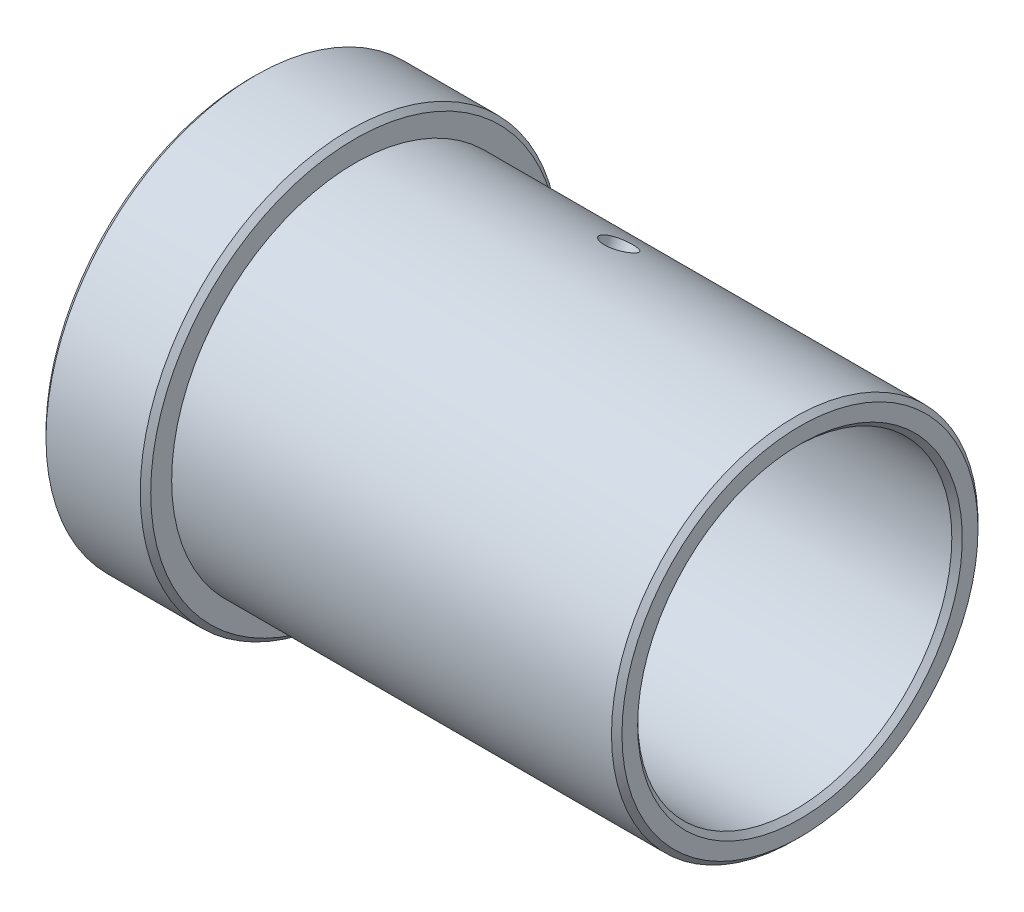
ISO-10303-21;
HEADER;
FILE_DESCRIPTION(('STEP AP214'),'2;1');
FILE_NAME('part.step','',(''),(''),'','','');
FILE_SCHEMA(('AUTOMOTIVE_DESIGN { 1 0 10303 214 1 1 1 1 }'));
ENDSEC;
DATA;
#1=APPLICATION_CONTEXT('core data for automotive mechanical design processes');
#2=APPLICATION_PROTOCOL_DEFINITION('international standard','automotive_design',2000,#1);
#3=PRODUCT_CONTEXT('',#1,'mechanical');
#4=PRODUCT('Part','Part','',(#3));
#5=PRODUCT_RELATED_PRODUCT_CATEGORY('part','',(#4));
#6=PRODUCT_DEFINITION_FORMATION('','',#4);
#7=PRODUCT_DEFINITION_CONTEXT('part definition',#1,'design');
#8=PRODUCT_DEFINITION('design','',#6,#7);
#9=PRODUCT_DEFINITION_SHAPE('','',#8);
#10=(LENGTH_UNIT() NAMED_UNIT(*) SI_UNIT(.MILLI.,.METRE.));
#11=(NAMED_UNIT(*) PLANE_ANGLE_UNIT() SI_UNIT($,.RADIAN.));
#12=(NAMED_UNIT(*) SI_UNIT($,.STERADIAN.) SOLID_ANGLE_UNIT());
#13=UNCERTAINTY_MEASURE_WITH_UNIT(LENGTH_MEASURE(1.E-05),#10,'distance_accuracy_value','');
#14=(GEOMETRIC_REPRESENTATION_CONTEXT(3) GLOBAL_UNCERTAINTY_ASSIGNED_CONTEXT((#13)) GLOBAL_UNIT_ASSIGNED_CONTEXT((#10,
#11,#12)) REPRESENTATION_CONTEXT('',''));
#15=CARTESIAN_POINT('',(0.,0.,0.));
#16=DIRECTION('',(0.,0.,1.));
#17=DIRECTION('',(1.,0.,0.));
#18=AXIS2_PLACEMENT_3D('',#15,#16,#17);
#19=CARTESIAN_POINT('',(0.,0.,0.));
#20=DIRECTION('',(-1.,0.,0.));
#21=DIRECTION('',(0.,0.,1.));
#22=AXIS2_PLACEMENT_3D('',#19,#20,#21);
#23=CYLINDRICAL_SURFACE('',#22,30.);
#24=CARTESIAN_POINT('',(104.,0.,0.));
#25=DIRECTION('',(-1.,0.,0.));
#26=DIRECTION('',(0.,0.,1.));
#27=AXIS2_PLACEMENT_3D('',#24,#25,#26);
#28=CIRCLE('',#27,30.);
#29=CARTESIAN_POINT('',(104.,0.,30.));
#30=VERTEX_POINT('',#29);
#31=EDGE_CURVE('E77',#30,#30,#28,.F.);
#32=ORIENTED_EDGE('',*,*,#31,.T.);
#33=EDGE_LOOP('',(#32));
#34=FACE_BOUND('',#33,.T.);
#35=CARTESIAN_POINT('',(0.999999999999985,0.,0.));
#36=DIRECTION('',(1.,0.,0.));
#37=DIRECTION('',(0.,0.,-1.));
#38=AXIS2_PLACEMENT_3D('',#35,#36,#37);
#39=CIRCLE('',#38,30.);
#40=CARTESIAN_POINT('',(0.999999999999985,0.,-30.));
#41=VERTEX_POINT('',#40);
#42=EDGE_CURVE('E80',#41,#41,#39,.F.);
#43=ORIENTED_EDGE('',*,*,#42,.T.);
#44=EDGE_LOOP('',(#43));
#45=FACE_BOUND('',#44,.T.);
#46=CARTESIAN_POINT('',(55.,25.4821235078622,-15.8322892068727));
#47=CARTESIAN_POINT('',(55.1680586925268,25.4821284814457,-15.8322835374842));
#48=CARTESIAN_POINT('',(55.3362285052549,25.4896484346966,-15.8201976358381));
#49=CARTESIAN_POINT('',(55.6679055588989,25.5194270348919,-15.7721150314666));
#50=CARTESIAN_POINT('',(55.8314074541161,25.5417019244503,-15.7360919779697));
#51=CARTESIAN_POINT('',(56.1488974576473,25.600019021593,-15.6410394826798));
#52=CARTESIAN_POINT('',(56.3028912681726,25.6360528825922,-15.5820239883173));
#53=CARTESIAN_POINT('',(56.597103376877,25.72036704279,-15.4424523564029));
#54=CARTESIAN_POINT('',(56.7373244034516,25.7686449096291,-15.3619004970317));
#55=CARTESIAN_POINT('',(57.000553790972,25.8756689901483,-15.1809356798347));
#56=CARTESIAN_POINT('',(57.1235050285112,25.9344485485519,-15.0804593431792));
#57=CARTESIAN_POINT('',(57.3482128270108,26.0600760895089,-14.8623095281687));
#58=CARTESIAN_POINT('',(57.449968418219,26.1269244410083,-14.7446352633855));
#59=CARTESIAN_POINT('',(57.6295937710214,26.2663412395531,-14.4948194388529));
#60=CARTESIAN_POINT('',(57.707412996381,26.3389213877216,-14.362648058539));
#61=CARTESIAN_POINT('',(57.8366332994461,26.4870945543933,-14.0875195980929));
#62=CARTESIAN_POINT('',(57.8880350211084,26.5626874994077,-13.9445627809656));
#63=CARTESIAN_POINT('',(57.9627937280598,26.7140987576482,-13.652249471918));
#64=CARTESIAN_POINT('',(57.9862444982498,26.7899154566498,-13.5029161326779));
#65=CARTESIAN_POINT('',(58.0047258074012,26.9396833855675,-13.201581770388));
#66=CARTESIAN_POINT('',(57.9997570832388,27.0136346638014,-13.0495808166074));
#67=CARTESIAN_POINT('',(57.9616165820495,27.1573367276951,-12.7478194164657));
#68=CARTESIAN_POINT('',(57.9285456533083,27.227101579624,-12.5980529046384));
#69=CARTESIAN_POINT('',(57.8352966131601,27.3609908490052,-12.3045607133587));
#70=CARTESIAN_POINT('',(57.7751181496373,27.4251151931767,-12.1608351124018));
#71=CARTESIAN_POINT('',(57.6292517102367,27.5464566157226,-11.8834218530757));
#72=CARTESIAN_POINT('',(57.5435191074095,27.6036613621877,-11.7497522719382));
#73=CARTESIAN_POINT('',(57.3490104299909,27.7099979778308,-11.4967332781471));
#74=CARTESIAN_POINT('',(57.2402336795645,27.7591296101666,-11.3773842856462));
#75=CARTESIAN_POINT('',(57.0021573114591,27.8487798140327,-11.1561553836747));
#76=CARTESIAN_POINT('',(56.8727699657753,27.8892597526081,-11.0543542071557));
#77=CARTESIAN_POINT('',(56.5974494043677,27.9608322274898,-10.8720505560648));
#78=CARTESIAN_POINT('',(56.4515161646436,27.9919247501792,-10.7915481123878));
#79=CARTESIAN_POINT('',(56.1471789244006,28.0444114552492,-10.654407792725));
#80=CARTESIAN_POINT('',(55.9887723027313,28.065803592778,-10.5977749486539));
#81=CARTESIAN_POINT('',(55.6640181861559,28.098694358771,-10.5102607225316));
#82=CARTESIAN_POINT('',(55.4976709333377,28.1101932886485,-10.4793785559429));
#83=CARTESIAN_POINT('',(55.1625274614115,28.1231820887286,-10.4444713196383));
#84=CARTESIAN_POINT('',(54.9937449392055,28.1247150164341,-10.4403307151518));
#85=CARTESIAN_POINT('',(54.6578462025314,28.1178752139908,-10.4587373077393));
#86=CARTESIAN_POINT('',(54.4907299655789,28.1095026176875,-10.4812841442075));
#87=CARTESIAN_POINT('',(54.163265253165,28.0829425408111,-10.5522392692784));
#88=CARTESIAN_POINT('',(54.002903286716,28.0647757338674,-10.6005930823382));
#89=CARTESIAN_POINT('',(53.6930798448091,28.0187888202506,-10.7215500308448));
#90=CARTESIAN_POINT('',(53.5436186191385,27.9909684924539,-10.794153721758));
#91=CARTESIAN_POINT('',(53.2592800779137,27.9258274382962,-10.9615796082132));
#92=CARTESIAN_POINT('',(53.1244541741012,27.8884746732919,-11.0564766447761));
#93=CARTESIAN_POINT('',(52.8737348401778,27.8047452013612,-11.2653794611083));
#94=CARTESIAN_POINT('',(52.7578418789798,27.7583682709952,-11.3793857140147));
#95=CARTESIAN_POINT('',(52.5478550998057,27.6570595074037,-11.6234481140415));
#96=CARTESIAN_POINT('',(52.4538413212413,27.6020974555902,-11.7535606039818));
#97=CARTESIAN_POINT('',(52.2908323944808,27.4846877209687,-12.0255499538576));
#98=CARTESIAN_POINT('',(52.2218369034787,27.4222401407445,-12.1674266525647));
#99=CARTESIAN_POINT('',(52.110958697034,27.291263029686,-12.458425027677));
#100=CARTESIAN_POINT('',(52.0690276380244,27.2227445933224,-12.6075332715289));
#101=CARTESIAN_POINT('',(52.0133107912605,27.0811738841439,-12.9088230121345));
#102=CARTESIAN_POINT('',(51.9995242124979,27.0081217388096,-13.0610044223947));
#103=CARTESIAN_POINT('',(52.0004987993198,26.859798202844,-13.3633631514256));
#104=CARTESIAN_POINT('',(52.01513571051,26.784537881668,-13.5135463162776));
#105=CARTESIAN_POINT('',(52.0722812369709,26.633744948393,-13.8083690537843));
#106=CARTESIAN_POINT('',(52.1147898741189,26.5582123360802,-13.9530086220878));
#107=CARTESIAN_POINT('',(52.2264377721788,26.4093316844748,-14.2327906467814));
#108=CARTESIAN_POINT('',(52.2955734008025,26.3359833486864,-14.3679343955602));
#109=CARTESIAN_POINT('',(52.4584995067509,26.193991697775,-14.6251979228174));
#110=CARTESIAN_POINT('',(52.5522898398134,26.1253483551245,-14.7473177774969));
#111=CARTESIAN_POINT('',(52.7623288570713,25.9949901096164,-14.9759108305594));
#112=CARTESIAN_POINT('',(52.8786700487344,25.9333054605788,-15.0823162842988));
#113=CARTESIAN_POINT('',(53.1303260546363,25.8195591778534,-15.276224552438));
#114=CARTESIAN_POINT('',(53.2656454155072,25.7674998570708,-15.3637228244121));
#115=CARTESIAN_POINT('',(53.5517930257598,25.6749993406956,-15.5178133497399));
#116=CARTESIAN_POINT('',(53.7026598439722,25.6345880305175,-15.5843518663103));
#117=CARTESIAN_POINT('',(54.0152448737386,25.5672959735576,-15.6945080006873));
#118=CARTESIAN_POINT('',(54.1769506117769,25.5403999662677,-15.7381514723922));
#119=CARTESIAN_POINT('',(54.4496432226975,25.5079978177134,-15.7905860031988));
#120=CARTESIAN_POINT('',(54.5588867539198,25.4983137343006,-15.8062060380578));
#121=CARTESIAN_POINT('',(54.7787374691272,25.4853749554845,-15.8270594845498));
#122=CARTESIAN_POINT('',(54.8893446473859,25.4821202330917,-15.832292939784));
#123=CARTESIAN_POINT('',(55.,25.4821235078622,-15.8322892068727));
#124=B_SPLINE_CURVE_WITH_KNOTS('',3,(#46,#47,#48,#49,#50,#51,#52,#53,#54,#55,#56,#57,#58,#59,
#60,#61,#62,#63,#64,#65,#66,#67,#68,#69,#70,#71,#72,#73,#74,#75,#76,#77,#78,#79,#80,#81,#82,#83,
#84,#85,#86,#87,#88,#89,#90,#91,#92,#93,#94,#95,#96,#97,#98,#99,#100,#101,#102,#103,#104,#105,
#106,#107,#108,#109,#110,#111,#112,#113,#114,#115,#116,#117,#118,#119,#120,#121,#122,#123),
.UNSPECIFIED.,.T.,.F.,(4,2,2,2,2,2,2,2,2,2,2,2,2,2,2,2,2,2,2,2,2,2,2,2,2,2,2,2,2,2,2,2,2,2,2,2,
2,2,4),(0.,0.503771983318817,1.00809945548361,1.51212147301072,2.01604344128224,
2.52159484591606,3.02716937567589,3.53380409915706,4.04042647225215,4.5453441269718,
5.05024868996528,5.55334895457816,6.05645575444755,6.56044636401072,7.06445175657417,
7.57066275256835,8.07687448284519,8.58319287355632,9.0894958378693,9.59360988925127,
10.0977171290244,10.6007644411541,11.1038232768497,11.6085956943698,12.1133806117144,
12.6199841045619,13.1265806555585,13.6322697808491,14.1379446934128,14.6414140040728,
15.1448837099181,15.6482847598757,16.1516828643423,16.657191451158,17.1628213510541,
17.6697372321326,18.1760794468383,18.5077808281997,18.8394808171328),.UNSPECIFIED.);
#125=CARTESIAN_POINT('',(55.,25.4821235078622,-15.8322892068727));
#126=VERTEX_POINT('',#125);
#127=EDGE_CURVE('E92',#126,#126,#124,.T.);
#128=ORIENTED_EDGE('',*,*,#127,.F.);
#129=EDGE_LOOP('',(#128));
#130=FACE_BOUND('',#129,.T.);
#131=ADVANCED_FACE('F45',(#34,#45,#130),#23,.F.);
#132=CARTESIAN_POINT('',(0.,0.,0.));
#133=DIRECTION('',(-1.,0.,0.));
#134=DIRECTION('',(0.,0.,1.));
#135=AXIS2_PLACEMENT_3D('',#132,#133,#134);
#136=CYLINDRICAL_SURFACE('',#135,35.);
#137=CARTESIAN_POINT('',(104.,0.,0.));
#138=DIRECTION('',(-1.,0.,0.));
#139=DIRECTION('',(0.,0.,1.));
#140=AXIS2_PLACEMENT_3D('',#137,#138,#139);
#141=CIRCLE('',#140,35.);
#142=CARTESIAN_POINT('',(104.,0.,35.));
#143=VERTEX_POINT('',#142);
#144=EDGE_CURVE('E74',#143,#143,#141,.T.);
#145=ORIENTED_EDGE('',*,*,#144,.T.);
#146=EDGE_LOOP('',(#145));
#147=FACE_BOUND('',#146,.T.);
#148=CARTESIAN_POINT('',(20.,0.,0.));
#149=DIRECTION('',(-1.,0.,0.));
#150=DIRECTION('',(0.,0.,1.));
#151=AXIS2_PLACEMENT_3D('',#148,#149,#150);
#152=CIRCLE('',#151,35.);
#153=CARTESIAN_POINT('',(20.,0.,35.));
#154=VERTEX_POINT('',#153);
#155=EDGE_CURVE('E89',#154,#154,#152,.T.);
#156=ORIENTED_EDGE('',*,*,#155,.F.);
#157=EDGE_LOOP('',(#156));
#158=FACE_BOUND('',#157,.T.);
#159=CARTESIAN_POINT('',(55.,29.9910938663542,-18.0425687943688));
#160=CARTESIAN_POINT('',(54.8318211022031,29.9910986269096,-18.042562954599));
#161=CARTESIAN_POINT('',(54.6635281444135,29.9984437679033,-18.0303688947264));
#162=CARTESIAN_POINT('',(54.331599928892,30.027545382464,-17.9818599549949));
#163=CARTESIAN_POINT('',(54.1679701474462,30.049318126291,-17.9455178428279));
#164=CARTESIAN_POINT('',(53.8502236835194,30.1063690354561,-17.8496396804783));
#165=CARTESIAN_POINT('',(53.6961016169177,30.1416394741331,-17.7901168995642));
#166=CARTESIAN_POINT('',(53.4016582013193,30.2242571782809,-17.6493881952773));
#167=CARTESIAN_POINT('',(53.2613339381889,30.2716018860092,-17.568186863991));
#168=CARTESIAN_POINT('',(52.9980531789911,30.3766508800125,-17.3859178496988));
#169=CARTESIAN_POINT('',(52.8751392165071,30.4343797805365,-17.2848029091001));
#170=CARTESIAN_POINT('',(52.6505336642643,30.5579433481812,-17.0654011570217));
#171=CARTESIAN_POINT('',(52.5488430073913,30.6237783714103,-16.947113591094));
#172=CARTESIAN_POINT('',(52.3694283036221,30.7612751331111,-16.6962394849455));
#173=CARTESIAN_POINT('',(52.2917411960924,30.8329456398523,-16.5636313255907));
#174=CARTESIAN_POINT('',(52.1627751263907,30.9795418603791,-16.2877977002581));
#175=CARTESIAN_POINT('',(52.1114956781334,31.0544675142198,-16.1445724297648));
#176=CARTESIAN_POINT('',(52.0369233755909,31.2049316078513,-15.8517901946811));
#177=CARTESIAN_POINT('',(52.0135615290964,31.2804680706289,-15.7022497884083));
#178=CARTESIAN_POINT('',(51.9952742830879,31.430030834878,-15.400697451729));
#179=CARTESIAN_POINT('',(52.0003483272502,31.5040571658655,-15.2486855697329));
#180=CARTESIAN_POINT('',(52.0387324610289,31.6483297219421,-14.9469437582818));
#181=CARTESIAN_POINT('',(52.0719683603836,31.7185853640029,-14.7972088842852));
#182=CARTESIAN_POINT('',(52.165617371239,31.8537499464227,-14.5039546281513));
#183=CARTESIAN_POINT('',(52.2260307539906,31.9186588334096,-14.3604353080653));
#184=CARTESIAN_POINT('',(52.372402327149,32.0417506049493,-14.083650625314));
#185=CARTESIAN_POINT('',(52.4583936918608,32.0999246174932,-13.9503988638708));
#186=CARTESIAN_POINT('',(52.6534561621967,32.2083016254089,-13.6983269206173));
#187=CARTESIAN_POINT('',(52.7625277635218,32.2585044495405,-13.5795070488512));
#188=CARTESIAN_POINT('',(53.0010725884121,32.3502248823872,-13.3595370038661));
#189=CARTESIAN_POINT('',(53.1306102882316,32.3917140435446,-13.2584448785054));
#190=CARTESIAN_POINT('',(53.406185663845,32.4651788356725,-13.0775275941522));
#191=CARTESIAN_POINT('',(53.5522233544131,32.4971544581244,-12.9977024542025));
#192=CARTESIAN_POINT('',(53.8566991911418,32.5511719253076,-12.8618264417753));
#193=CARTESIAN_POINT('',(54.0151389919861,32.5732124418412,-12.8057787480995));
#194=CARTESIAN_POINT('',(54.3398994886251,32.6070881236893,-12.7192759674394));
#195=CARTESIAN_POINT('',(54.5062200089057,32.6189235161727,-12.6888203107692));
#196=CARTESIAN_POINT('',(54.8414548095081,32.6322353972081,-12.6545468771331));
#197=CARTESIAN_POINT('',(55.0103591658262,32.6337446903427,-12.6506447435274));
#198=CARTESIAN_POINT('',(55.3464641685157,32.626474960573,-12.6693815432767));
#199=CARTESIAN_POINT('',(55.5136648316971,32.6176960392802,-12.6920202145016));
#200=CARTESIAN_POINT('',(55.8413568051811,32.5899683501166,-12.763048140015));
#201=CARTESIAN_POINT('',(56.0018579621147,32.571035117787,-12.8113980565472));
#202=CARTESIAN_POINT('',(56.3119000388947,32.5232286235924,-12.9322774386724));
#203=CARTESIAN_POINT('',(56.461440772822,32.4943551931616,-13.0048073143087));
#204=CARTESIAN_POINT('',(56.7457295680083,32.4269503115543,-13.171978039517));
#205=CARTESIAN_POINT('',(56.8804395313929,32.3883947846504,-13.2666739672662));
#206=CARTESIAN_POINT('',(57.1308576448824,32.3022159328818,-13.4751450623433));
#207=CARTESIAN_POINT('',(57.2465654491355,32.2545924430083,-13.588920576856));
#208=CARTESIAN_POINT('',(57.4560029728843,32.1509246692412,-13.832409905963));
#209=CARTESIAN_POINT('',(57.549674065437,32.0948585592977,-13.9621648677758));
#210=CARTESIAN_POINT('',(57.7119767717214,31.9754674227437,-14.2334611860138));
#211=CARTESIAN_POINT('',(57.7806086481032,31.9121424722844,-14.3750024187872));
#212=CARTESIAN_POINT('',(57.8907842087084,31.7797055555372,-14.6654606440385));
#213=CARTESIAN_POINT('',(57.932364035361,31.7106014503584,-14.8143675082185));
#214=CARTESIAN_POINT('',(57.9873733013822,31.5682373535997,-15.1153595140001));
#215=CARTESIAN_POINT('',(58.0008033075618,31.4949774457296,-15.2674445915446));
#216=CARTESIAN_POINT('',(57.9991249178628,31.3465478491248,-15.5699142268392));
#217=CARTESIAN_POINT('',(57.9841078420171,31.2713850331305,-15.72030267234));
#218=CARTESIAN_POINT('',(57.9261521408573,31.1211575096714,-16.015649102357));
#219=CARTESIAN_POINT('',(57.8832134794582,31.0460928023334,-16.1606070798549));
#220=CARTESIAN_POINT('',(57.7706569781232,30.8984607950413,-16.4411149547112));
#221=CARTESIAN_POINT('',(57.701040922428,30.8258933284201,-16.576665480544));
#222=CARTESIAN_POINT('',(57.5371161153677,30.6857031623583,-16.8347621628325));
#223=CARTESIAN_POINT('',(57.4428077217697,30.6180803912923,-16.9573085076694));
#224=CARTESIAN_POINT('',(57.2318324384592,30.4899804575952,-17.1865767376603));
#225=CARTESIAN_POINT('',(57.1150978861274,30.4295258383844,-17.2932489545616));
#226=CARTESIAN_POINT('',(56.8627082072799,30.3182442996148,-17.4876139341155));
#227=CARTESIAN_POINT('',(56.7270485112192,30.2674197122725,-17.5753020999116));
#228=CARTESIAN_POINT('',(56.4403813349937,30.1772998505576,-17.7295966693167));
#229=CARTESIAN_POINT('',(56.2893442935208,30.1380273695206,-17.7961614146499));
#230=CARTESIAN_POINT('',(55.9765267772395,30.0727632433514,-17.9062291764364));
#231=CARTESIAN_POINT('',(55.8147588646337,30.0467563682667,-17.9497586413536));
#232=CARTESIAN_POINT('',(55.5433679219208,30.0156960783794,-18.0016253880285));
#233=CARTESIAN_POINT('',(55.4354890428811,30.0064870523051,-18.0169608836886));
#234=CARTESIAN_POINT('',(55.218422813093,29.9941844090435,-18.0374344687274));
#235=CARTESIAN_POINT('',(55.109235466106,29.9910907742809,-18.0425725874129));
#236=CARTESIAN_POINT('',(55.,29.9910938663542,-18.0425687943688));
#237=B_SPLINE_CURVE_WITH_KNOTS('',3,(#159,#160,#161,#162,#163,#164,#165,#166,#167,#168,#169,
#170,#171,#172,#173,#174,#175,#176,#177,#178,#179,#180,#181,#182,#183,#184,#185,#186,#187,#188,
#189,#190,#191,#192,#193,#194,#195,#196,#197,#198,#199,#200,#201,#202,#203,#204,#205,#206,#207,
#208,#209,#210,#211,#212,#213,#214,#215,#216,#217,#218,#219,#220,#221,#222,#223,#224,#225,#226,
#227,#228,#229,#230,#231,#232,#233,#234,#235,#236),.UNSPECIFIED.,.T.,.F.,(4,2,2,2,2,2,2,2,2,2,2,
2,2,2,2,2,2,2,2,2,2,2,2,2,2,2,2,2,2,2,2,2,2,2,2,2,2,2,4),(0.,0.504137845154901,1.0088451851254,
1.51326404003696,2.01757613044269,2.52309976273197,3.0286456110007,3.53496561920689,
4.04127630725864,4.5463331550716,5.0513801219166,5.55510070289604,6.05882631148134,
6.56320811562686,7.06760075362891,7.57361533214637,8.07963036375614,8.5857130231065,
9.09178441661877,9.5962473420388,10.1007052851759,10.6043936277359,11.1080905122643,
11.6130525231886,12.1180237237333,12.6243235404852,13.1306180462274,13.6362347291713,
14.1418412311696,14.6458273992463,15.1498142186598,15.653767336246,16.1577131524622,
16.6632040203355,17.1688171527569,17.6754213142689,18.1814425380561,18.5088908177617,
18.836338156391),.UNSPECIFIED.);
#238=CARTESIAN_POINT('',(55.,29.9910938663542,-18.0425687943688));
#239=VERTEX_POINT('',#238);
#240=EDGE_CURVE('E50',#239,#239,#237,.T.);
#241=ORIENTED_EDGE('',*,*,#240,.F.);
#242=EDGE_LOOP('',(#241));
#243=FACE_BOUND('',#242,.T.);
#244=ADVANCED_FACE('F111',(#147,#158,#243),#136,.T.);
#245=CARTESIAN_POINT('',(0.,0.,0.));
#246=DIRECTION('',(-1.,0.,0.));
#247=DIRECTION('',(0.,0.,1.));
#248=AXIS2_PLACEMENT_3D('',#245,#246,#247);
#249=CYLINDRICAL_SURFACE('',#248,40.);
#250=CARTESIAN_POINT('',(1.00000000000002,0.,0.));
#251=DIRECTION('',(1.,0.,0.));
#252=DIRECTION('',(0.,0.,-1.));
#253=AXIS2_PLACEMENT_3D('',#250,#251,#252);
#254=CIRCLE('',#253,40.);
#255=CARTESIAN_POINT('',(1.00000000000002,0.,-40.));
#256=VERTEX_POINT('',#255);
#257=EDGE_CURVE('E59',#256,#256,#254,.T.);
#258=ORIENTED_EDGE('',*,*,#257,.T.);
#259=EDGE_LOOP('',(#258));
#260=FACE_BOUND('',#259,.T.);
#261=CARTESIAN_POINT('',(19.,0.,0.));
#262=DIRECTION('',(-1.,0.,0.));
#263=DIRECTION('',(0.,0.,1.));
#264=AXIS2_PLACEMENT_3D('',#261,#262,#263);
#265=CIRCLE('',#264,40.);
#266=CARTESIAN_POINT('',(19.,0.,40.));
#267=VERTEX_POINT('',#266);
#268=EDGE_CURVE('E63',#267,#267,#265,.T.);
#269=ORIENTED_EDGE('',*,*,#268,.T.);
#270=EDGE_LOOP('',(#269));
#271=FACE_BOUND('',#270,.T.);
#272=ADVANCED_FACE('F114',(#260,#271),#249,.T.);
#273=CARTESIAN_POINT('',(0.,40.,0.));
#274=DIRECTION('',(1.,0.,0.));
#275=DIRECTION('',(0.,0.,-1.));
#276=AXIS2_PLACEMENT_3D('',#273,#274,#275);
#277=PLANE('',#276);
#278=CARTESIAN_POINT('',(0.,0.,0.));
#279=DIRECTION('',(1.,0.,0.));
#280=DIRECTION('',(0.,0.,-1.));
#281=AXIS2_PLACEMENT_3D('',#278,#279,#280);
#282=CIRCLE('',#281,39.);
#283=CARTESIAN_POINT('',(0.,0.,-39.));
#284=VERTEX_POINT('',#283);
#285=EDGE_CURVE('E68',#284,#284,#282,.F.);
#286=ORIENTED_EDGE('',*,*,#285,.T.);
#287=EDGE_LOOP('',(#286));
#288=FACE_BOUND('',#287,.T.);
#289=CARTESIAN_POINT('',(0.,0.,0.));
#290=DIRECTION('',(1.,0.,0.));
#291=DIRECTION('',(0.,0.,-1.));
#292=AXIS2_PLACEMENT_3D('',#289,#290,#291);
#293=CIRCLE('',#292,31.);
#294=CARTESIAN_POINT('',(0.,0.,-31.));
#295=VERTEX_POINT('',#294);
#296=EDGE_CURVE('E71',#295,#295,#293,.T.);
#297=ORIENTED_EDGE('',*,*,#296,.T.);
#298=EDGE_LOOP('',(#297));
#299=FACE_BOUND('',#298,.T.);
#300=ADVANCED_FACE('F117',(#288,#299),#277,.F.);
#301=CARTESIAN_POINT('',(105.,30.,0.));
#302=DIRECTION('',(-1.,0.,0.));
#303=DIRECTION('',(0.,0.,1.));
#304=AXIS2_PLACEMENT_3D('',#301,#302,#303);
#305=PLANE('',#304);
#306=CARTESIAN_POINT('',(105.,0.,0.));
#307=DIRECTION('',(-1.,0.,0.));
#308=DIRECTION('',(0.,0.,1.));
#309=AXIS2_PLACEMENT_3D('',#306,#307,#308);
#310=CIRCLE('',#309,31.);
#311=CARTESIAN_POINT('',(105.,0.,31.));
#312=VERTEX_POINT('',#311);
#313=EDGE_CURVE('E83',#312,#312,#310,.T.);
#314=ORIENTED_EDGE('',*,*,#313,.T.);
#315=EDGE_LOOP('',(#314));
#316=FACE_BOUND('',#315,.T.);
#317=CARTESIAN_POINT('',(105.,0.,0.));
#318=DIRECTION('',(-1.,0.,0.));
#319=DIRECTION('',(0.,0.,1.));
#320=AXIS2_PLACEMENT_3D('',#317,#318,#319);
#321=CIRCLE('',#320,34.);
#322=CARTESIAN_POINT('',(105.,0.,34.));
#323=VERTEX_POINT('',#322);
#324=EDGE_CURVE('E86',#323,#323,#321,.F.);
#325=ORIENTED_EDGE('',*,*,#324,.T.);
#326=EDGE_LOOP('',(#325));
#327=FACE_BOUND('',#326,.T.);
#328=ADVANCED_FACE('F110',(#316,#327),#305,.F.);
#329=CARTESIAN_POINT('',(20.,35.,0.));
#330=DIRECTION('',(-1.,0.,0.));
#331=DIRECTION('',(0.,0.,1.));
#332=AXIS2_PLACEMENT_3D('',#329,#330,#331);
#333=PLANE('',#332);
#334=CARTESIAN_POINT('',(20.,0.,0.));
#335=DIRECTION('',(-1.,0.,0.));
#336=DIRECTION('',(0.,0.,1.));
#337=AXIS2_PLACEMENT_3D('',#334,#335,#336);
#338=CIRCLE('',#337,39.);
#339=CARTESIAN_POINT('',(20.,0.,39.));
#340=VERTEX_POINT('',#339);
#341=EDGE_CURVE('E10',#340,#340,#338,.F.);
#342=ORIENTED_EDGE('',*,*,#341,.T.);
#343=EDGE_LOOP('',(#342));
#344=FACE_BOUND('',#343,.T.);
#345=ORIENTED_EDGE('',*,*,#155,.T.);
#346=EDGE_LOOP('',(#345));
#347=FACE_BOUND('',#346,.T.);
#348=ADVANCED_FACE('F106',(#344,#347),#333,.F.);
#349=CARTESIAN_POINT('',(105.,0.,0.));
#350=DIRECTION('',(1.,0.,0.));
#351=DIRECTION('',(0.,0.,-1.));
#352=AXIS2_PLACEMENT_3D('',#349,#350,#351);
#353=CONICAL_SURFACE('',#352,31.,0.785398163397447);
#354=ORIENTED_EDGE('',*,*,#31,.F.);
#355=EDGE_LOOP('',(#354));
#356=FACE_BOUND('',#355,.T.);
#357=ORIENTED_EDGE('',*,*,#313,.F.);
#358=EDGE_LOOP('',(#357));
#359=FACE_BOUND('',#358,.T.);
#360=ADVANCED_FACE('F109',(#356,#359),#353,.F.);
#361=CARTESIAN_POINT('',(104.,0.,0.));
#362=DIRECTION('',(-1.,0.,0.));
#363=DIRECTION('',(0.,0.,1.));
#364=AXIS2_PLACEMENT_3D('',#361,#362,#363);
#365=CONICAL_SURFACE('',#364,35.,0.785398163397448);
#366=ORIENTED_EDGE('',*,*,#324,.F.);
#367=EDGE_LOOP('',(#366));
#368=FACE_BOUND('',#367,.T.);
#369=ORIENTED_EDGE('',*,*,#144,.F.);
#370=EDGE_LOOP('',(#369));
#371=FACE_BOUND('',#370,.T.);
#372=ADVANCED_FACE('F144',(#368,#371),#365,.T.);
#373=CARTESIAN_POINT('',(0.,0.,0.));
#374=DIRECTION('',(1.,0.,0.));
#375=DIRECTION('',(0.,0.,-1.));
#376=AXIS2_PLACEMENT_3D('',#373,#374,#375);
#377=CONICAL_SURFACE('',#376,39.,0.785398163397448);
#378=ORIENTED_EDGE('',*,*,#257,.F.);
#379=EDGE_LOOP('',(#378));
#380=FACE_BOUND('',#379,.T.);
#381=ORIENTED_EDGE('',*,*,#285,.F.);
#382=EDGE_LOOP('',(#381));
#383=FACE_BOUND('',#382,.T.);
#384=ADVANCED_FACE('F138',(#380,#383),#377,.T.);
#385=CARTESIAN_POINT('',(0.999999999999985,0.,0.));
#386=DIRECTION('',(-1.,0.,0.));
#387=DIRECTION('',(0.,0.,1.));
#388=AXIS2_PLACEMENT_3D('',#385,#386,#387);
#389=CONICAL_SURFACE('',#388,30.,0.785398163397452);
#390=ORIENTED_EDGE('',*,*,#296,.F.);
#391=EDGE_LOOP('',(#390));
#392=FACE_BOUND('',#391,.T.);
#393=ORIENTED_EDGE('',*,*,#42,.F.);
#394=EDGE_LOOP('',(#393));
#395=FACE_BOUND('',#394,.T.);
#396=ADVANCED_FACE('F136',(#392,#395),#389,.F.);
#397=CARTESIAN_POINT('',(19.,0.,0.));
#398=DIRECTION('',(-1.,0.,0.));
#399=DIRECTION('',(0.,0.,1.));
#400=AXIS2_PLACEMENT_3D('',#397,#398,#399);
#401=CONICAL_SURFACE('',#400,40.,0.785398163397441);
#402=ORIENTED_EDGE('',*,*,#341,.F.);
#403=EDGE_LOOP('',(#402));
#404=FACE_BOUND('',#403,.T.);
#405=ORIENTED_EDGE('',*,*,#268,.F.);
#406=EDGE_LOOP('',(#405));
#407=FACE_BOUND('',#406,.T.);
#408=ADVANCED_FACE('F48',(#404,#407),#401,.T.);
#409=CARTESIAN_POINT('',(55.,110.97920722727,-54.4015721702303));
#410=DIRECTION('',(0.,-0.89792072272698,0.44015721702303));
#411=DIRECTION('',(0.,-0.44015721702303,-0.89792072272698));
#412=AXIS2_PLACEMENT_3D('',#409,#410,#411);
#413=CYLINDRICAL_SURFACE('',#412,3.);
#414=ORIENTED_EDGE('',*,*,#240,.T.);
#415=EDGE_LOOP('',(#414));
#416=FACE_BOUND('',#415,.T.);
#417=ORIENTED_EDGE('',*,*,#127,.T.);
#418=EDGE_LOOP('',(#417));
#419=FACE_BOUND('',#418,.T.);
#420=ADVANCED_FACE('F101',(#416,#419),#413,.F.);
#421=CLOSED_SHELL('',(#131,#244,#272,#300,#328,#348,#360,#372,#384,#396,#408,#420));
#422=MANIFOLD_SOLID_BREP('B2',#421);
#423=ADVANCED_BREP_SHAPE_REPRESENTATION('',(#18,#422),#14);
#424=SHAPE_DEFINITION_REPRESENTATION(#9,#423);
ENDSEC;
END-ISO-10303-21;
